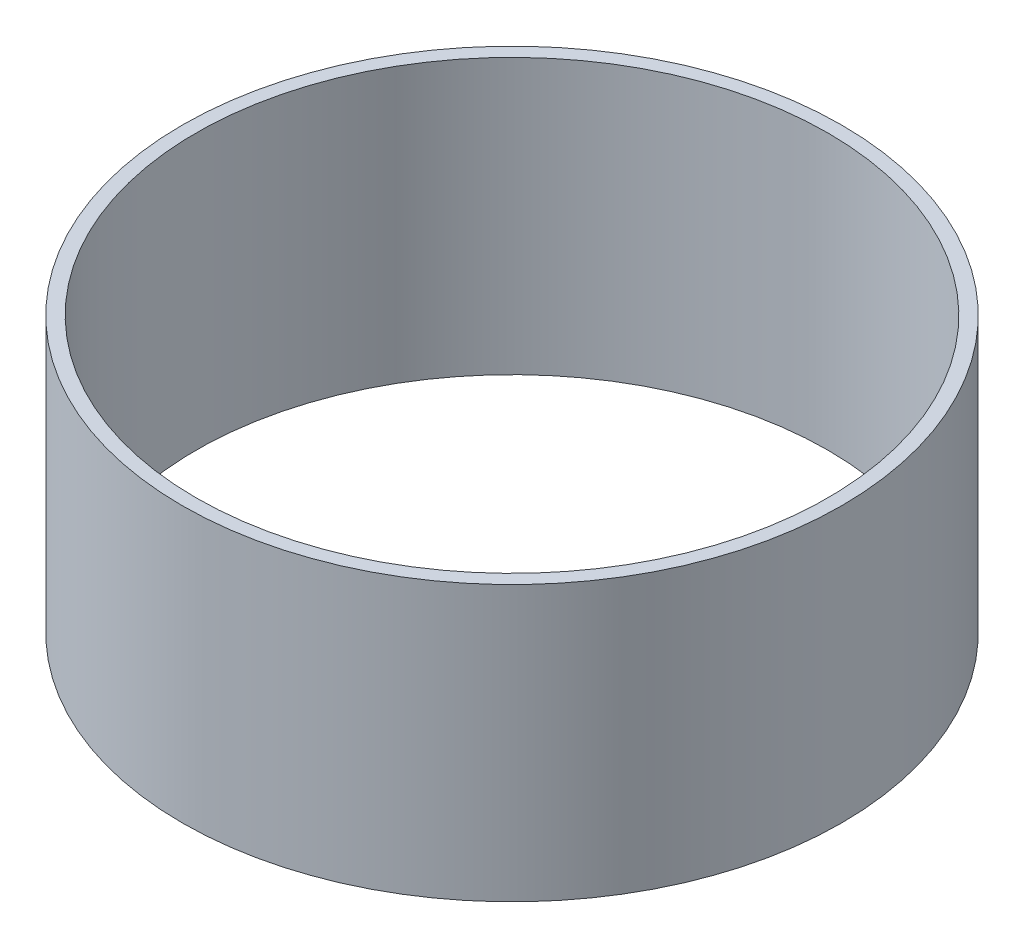
ISO-10303-21;
HEADER;
FILE_DESCRIPTION(('STEP AP214'),'2;1');
FILE_NAME('part.step','',(''),(''),'','','');
FILE_SCHEMA(('AUTOMOTIVE_DESIGN { 1 0 10303 214 1 1 1 1 }'));
ENDSEC;
DATA;
#1=APPLICATION_CONTEXT('core data for automotive mechanical design processes');
#2=APPLICATION_PROTOCOL_DEFINITION('international standard','automotive_design',2000,#1);
#3=PRODUCT_CONTEXT('',#1,'mechanical');
#4=PRODUCT('Part','Part','',(#3));
#5=PRODUCT_RELATED_PRODUCT_CATEGORY('part','',(#4));
#6=PRODUCT_DEFINITION_FORMATION('','',#4);
#7=PRODUCT_DEFINITION_CONTEXT('part definition',#1,'design');
#8=PRODUCT_DEFINITION('design','',#6,#7);
#9=PRODUCT_DEFINITION_SHAPE('','',#8);
#10=(LENGTH_UNIT() NAMED_UNIT(*) SI_UNIT(.MILLI.,.METRE.));
#11=(NAMED_UNIT(*) PLANE_ANGLE_UNIT() SI_UNIT($,.RADIAN.));
#12=(NAMED_UNIT(*) SI_UNIT($,.STERADIAN.) SOLID_ANGLE_UNIT());
#13=UNCERTAINTY_MEASURE_WITH_UNIT(LENGTH_MEASURE(1.E-05),#10,'distance_accuracy_value','');
#14=(GEOMETRIC_REPRESENTATION_CONTEXT(3) GLOBAL_UNCERTAINTY_ASSIGNED_CONTEXT((#13)) GLOBAL_UNIT_ASSIGNED_CONTEXT((#10,
#11,#12)) REPRESENTATION_CONTEXT('',''));
#15=CARTESIAN_POINT('',(0.,0.,0.));
#16=DIRECTION('',(0.,0.,1.));
#17=DIRECTION('',(1.,0.,0.));
#18=AXIS2_PLACEMENT_3D('',#15,#16,#17);
#19=CARTESIAN_POINT('',(0.,127.,0.));
#20=DIRECTION('',(0.,1.,0.));
#21=DIRECTION('',(0.,0.,1.));
#22=AXIS2_PLACEMENT_3D('',#19,#20,#21);
#23=PLANE('',#22);
#24=CARTESIAN_POINT('',(0.,127.,0.));
#25=DIRECTION('',(0.,1.,0.));
#26=DIRECTION('',(0.,0.,1.));
#27=AXIS2_PLACEMENT_3D('',#24,#25,#26);
#28=CIRCLE('',#27,152.4);
#29=CARTESIAN_POINT('',(0.,127.,152.4));
#30=VERTEX_POINT('',#29);
#31=EDGE_CURVE('E10',#30,#30,#28,.T.);
#32=ORIENTED_EDGE('',*,*,#31,.T.);
#33=EDGE_LOOP('',(#32));
#34=FACE_BOUND('',#33,.T.);
#35=CARTESIAN_POINT('',(0.,127.,0.));
#36=DIRECTION('',(0.,1.,0.));
#37=DIRECTION('',(0.,0.,1.));
#38=AXIS2_PLACEMENT_3D('',#35,#36,#37);
#39=CIRCLE('',#38,146.05);
#40=CARTESIAN_POINT('',(0.,127.,146.05));
#41=VERTEX_POINT('',#40);
#42=EDGE_CURVE('E48',#41,#41,#39,.T.);
#43=ORIENTED_EDGE('',*,*,#42,.F.);
#44=EDGE_LOOP('',(#43));
#45=FACE_BOUND('',#44,.T.);
#46=ADVANCED_FACE('F37',(#34,#45),#23,.T.);
#47=CARTESIAN_POINT('',(0.,0.,0.));
#48=DIRECTION('',(0.,1.,0.));
#49=DIRECTION('',(0.,0.,1.));
#50=AXIS2_PLACEMENT_3D('',#47,#48,#49);
#51=PLANE('',#50);
#52=CARTESIAN_POINT('',(0.,0.,0.));
#53=DIRECTION('',(0.,1.,0.));
#54=DIRECTION('',(0.,0.,1.));
#55=AXIS2_PLACEMENT_3D('',#52,#53,#54);
#56=CIRCLE('',#55,152.4);
#57=CARTESIAN_POINT('',(0.,0.,152.4));
#58=VERTEX_POINT('',#57);
#59=EDGE_CURVE('E41',#58,#58,#56,.T.);
#60=ORIENTED_EDGE('',*,*,#59,.F.);
#61=EDGE_LOOP('',(#60));
#62=FACE_BOUND('',#61,.T.);
#63=CARTESIAN_POINT('',(0.,0.,0.));
#64=DIRECTION('',(0.,1.,0.));
#65=DIRECTION('',(0.,0.,1.));
#66=AXIS2_PLACEMENT_3D('',#63,#64,#65);
#67=CIRCLE('',#66,146.05);
#68=CARTESIAN_POINT('',(0.,0.,146.05));
#69=VERTEX_POINT('',#68);
#70=EDGE_CURVE('E50',#69,#69,#67,.T.);
#71=ORIENTED_EDGE('',*,*,#70,.T.);
#72=EDGE_LOOP('',(#71));
#73=FACE_BOUND('',#72,.T.);
#74=ADVANCED_FACE('F60',(#62,#73),#51,.F.);
#75=CARTESIAN_POINT('',(0.,127.,0.));
#76=DIRECTION('',(0.,-1.,0.));
#77=DIRECTION('',(0.,0.,-1.));
#78=AXIS2_PLACEMENT_3D('',#75,#76,#77);
#79=CYLINDRICAL_SURFACE('',#78,152.4);
#80=ORIENTED_EDGE('',*,*,#31,.F.);
#81=EDGE_LOOP('',(#80));
#82=FACE_BOUND('',#81,.T.);
#83=ORIENTED_EDGE('',*,*,#59,.T.);
#84=EDGE_LOOP('',(#83));
#85=FACE_BOUND('',#84,.T.);
#86=ADVANCED_FACE('F39',(#82,#85),#79,.T.);
#87=CARTESIAN_POINT('',(0.,127.,0.));
#88=DIRECTION('',(0.,-1.,0.));
#89=DIRECTION('',(0.,0.,-1.));
#90=AXIS2_PLACEMENT_3D('',#87,#88,#89);
#91=CYLINDRICAL_SURFACE('',#90,146.05);
#92=ORIENTED_EDGE('',*,*,#42,.T.);
#93=EDGE_LOOP('',(#92));
#94=FACE_BOUND('',#93,.T.);
#95=ORIENTED_EDGE('',*,*,#70,.F.);
#96=EDGE_LOOP('',(#95));
#97=FACE_BOUND('',#96,.T.);
#98=ADVANCED_FACE('F56',(#94,#97),#91,.F.);
#99=CLOSED_SHELL('',(#46,#74,#86,#98));
#100=MANIFOLD_SOLID_BREP('B2',#99);
#101=ADVANCED_BREP_SHAPE_REPRESENTATION('',(#18,#100),#14);
#102=SHAPE_DEFINITION_REPRESENTATION(#9,#101);
ENDSEC;
END-ISO-10303-21;
